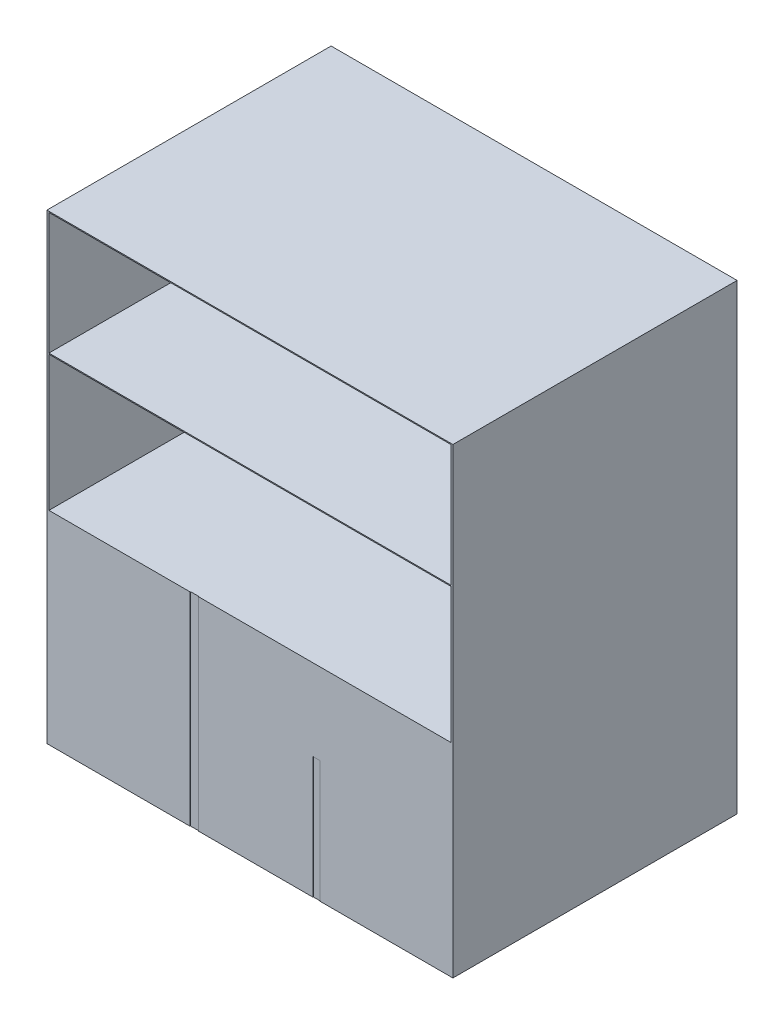
ISO-10303-21;
HEADER;
FILE_DESCRIPTION(('STEP AP214'),'2;1');
FILE_NAME('part.step','',(''),(''),'','','');
FILE_SCHEMA(('AUTOMOTIVE_DESIGN { 1 0 10303 214 1 1 1 1 }'));
ENDSEC;
DATA;
#1=APPLICATION_CONTEXT('core data for automotive mechanical design processes');
#2=APPLICATION_PROTOCOL_DEFINITION('international standard','automotive_design',2000,#1);
#3=PRODUCT_CONTEXT('',#1,'mechanical');
#4=PRODUCT('Part','Part','',(#3));
#5=PRODUCT_RELATED_PRODUCT_CATEGORY('part','',(#4));
#6=PRODUCT_DEFINITION_FORMATION('','',#4);
#7=PRODUCT_DEFINITION_CONTEXT('part definition',#1,'design');
#8=PRODUCT_DEFINITION('design','',#6,#7);
#9=PRODUCT_DEFINITION_SHAPE('','',#8);
#10=(LENGTH_UNIT() NAMED_UNIT(*) SI_UNIT(.MILLI.,.METRE.));
#11=(NAMED_UNIT(*) PLANE_ANGLE_UNIT() SI_UNIT($,.RADIAN.));
#12=(NAMED_UNIT(*) SI_UNIT($,.STERADIAN.) SOLID_ANGLE_UNIT());
#13=UNCERTAINTY_MEASURE_WITH_UNIT(LENGTH_MEASURE(1.E-05),#10,'distance_accuracy_value','');
#14=(GEOMETRIC_REPRESENTATION_CONTEXT(3) GLOBAL_UNCERTAINTY_ASSIGNED_CONTEXT((#13)) GLOBAL_UNIT_ASSIGNED_CONTEXT((#10,
#11,#12)) REPRESENTATION_CONTEXT('',''));
#15=CARTESIAN_POINT('',(0.,0.,0.));
#16=DIRECTION('',(0.,0.,1.));
#17=DIRECTION('',(1.,0.,0.));
#18=AXIS2_PLACEMENT_3D('',#15,#16,#17);
#19=CARTESIAN_POINT('',(1000.,1000.,-700.));
#20=DIRECTION('',(-1.,0.,0.));
#21=DIRECTION('',(0.,0.,1.));
#22=AXIS2_PLACEMENT_3D('',#19,#20,#21);
#23=PLANE('',#22);
#24=DIRECTION('',(0.,0.,-1.));
#25=VECTOR('',#24,1.);
#26=CARTESIAN_POINT('',(1000.,0.,-700.));
#27=LINE('',#26,#25);
#28=CARTESIAN_POINT('',(1000.,0.,700.));
#29=VERTEX_POINT('',#28);
#30=CARTESIAN_POINT('',(1000.,0.,-700.));
#31=VERTEX_POINT('',#30);
#32=EDGE_CURVE('E297',#29,#31,#27,.T.);
#33=ORIENTED_EDGE('',*,*,#32,.T.);
#34=DIRECTION('',(0.,-1.,0.));
#35=VECTOR('',#34,1.);
#36=CARTESIAN_POINT('',(1000.,1000.,-700.));
#37=LINE('',#36,#35);
#38=CARTESIAN_POINT('',(1000.,2276.,-700.));
#39=VERTEX_POINT('',#38);
#40=EDGE_CURVE('E11',#39,#31,#37,.T.);
#41=ORIENTED_EDGE('',*,*,#40,.F.);
#42=DIRECTION('',(0.,0.,-1.));
#43=VECTOR('',#42,1.);
#44=CARTESIAN_POINT('',(1000.,2276.,-700.));
#45=LINE('',#44,#43);
#46=CARTESIAN_POINT('',(1000.,2276.,700.));
#47=VERTEX_POINT('',#46);
#48=EDGE_CURVE('E216',#47,#39,#45,.T.);
#49=ORIENTED_EDGE('',*,*,#48,.F.);
#50=DIRECTION('',(0.,-1.,0.));
#51=VECTOR('',#50,1.);
#52=CARTESIAN_POINT('',(1000.,1000.,700.));
#53=LINE('',#52,#51);
#54=EDGE_CURVE('E308',#47,#29,#53,.T.);
#55=ORIENTED_EDGE('',*,*,#54,.T.);
#56=EDGE_LOOP('',(#33,#41,#49,#55));
#57=FACE_BOUND('',#56,.T.);
#58=ADVANCED_FACE('F35',(#57),#23,.F.);
#59=CARTESIAN_POINT('',(-1000.,1000.,-700.));
#60=DIRECTION('',(0.,0.,1.));
#61=DIRECTION('',(1.,0.,0.));
#62=AXIS2_PLACEMENT_3D('',#59,#60,#61);
#63=PLANE('',#62);
#64=DIRECTION('',(-1.,0.,0.));
#65=VECTOR('',#64,1.);
#66=CARTESIAN_POINT('',(-1000.,0.,-700.));
#67=LINE('',#66,#65);
#68=CARTESIAN_POINT('',(-1000.,0.,-700.));
#69=VERTEX_POINT('',#68);
#70=EDGE_CURVE('E312',#31,#69,#67,.T.);
#71=ORIENTED_EDGE('',*,*,#70,.T.);
#72=DIRECTION('',(0.,-1.,0.));
#73=VECTOR('',#72,1.);
#74=CARTESIAN_POINT('',(-1000.,1000.,-700.));
#75=LINE('',#74,#73);
#76=CARTESIAN_POINT('',(-1000.,2276.,-700.));
#77=VERTEX_POINT('',#76);
#78=EDGE_CURVE('E42',#77,#69,#75,.T.);
#79=ORIENTED_EDGE('',*,*,#78,.F.);
#80=DIRECTION('',(-1.,0.,0.));
#81=VECTOR('',#80,1.);
#82=CARTESIAN_POINT('',(-1000.,2276.,-700.));
#83=LINE('',#82,#81);
#84=EDGE_CURVE('E219',#39,#77,#83,.T.);
#85=ORIENTED_EDGE('',*,*,#84,.F.);
#86=ORIENTED_EDGE('',*,*,#40,.T.);
#87=EDGE_LOOP('',(#71,#79,#85,#86));
#88=FACE_BOUND('',#87,.T.);
#89=ADVANCED_FACE('F347',(#88),#63,.F.);
#90=CARTESIAN_POINT('',(-1000.,1000.,-700.));
#91=DIRECTION('',(1.,0.,0.));
#92=DIRECTION('',(0.,0.,-1.));
#93=AXIS2_PLACEMENT_3D('',#90,#91,#92);
#94=PLANE('',#93);
#95=DIRECTION('',(0.,0.,1.));
#96=VECTOR('',#95,1.);
#97=CARTESIAN_POINT('',(-1000.,0.,-700.));
#98=LINE('',#97,#96);
#99=CARTESIAN_POINT('',(-999.999999999999,0.,700.));
#100=VERTEX_POINT('',#99);
#101=EDGE_CURVE('E314',#69,#100,#98,.T.);
#102=ORIENTED_EDGE('',*,*,#101,.T.);
#103=DIRECTION('',(0.,-1.,0.));
#104=VECTOR('',#103,1.);
#105=CARTESIAN_POINT('',(-999.999999999999,1000.,700.));
#106=LINE('',#105,#104);
#107=CARTESIAN_POINT('',(-999.999999999999,2276.,700.));
#108=VERTEX_POINT('',#107);
#109=EDGE_CURVE('E323',#108,#100,#106,.T.);
#110=ORIENTED_EDGE('',*,*,#109,.F.);
#111=DIRECTION('',(0.,0.,1.));
#112=VECTOR('',#111,1.);
#113=CARTESIAN_POINT('',(-999.999999999999,2276.,700.));
#114=LINE('',#113,#112);
#115=EDGE_CURVE('E210',#77,#108,#114,.T.);
#116=ORIENTED_EDGE('',*,*,#115,.F.);
#117=ORIENTED_EDGE('',*,*,#78,.T.);
#118=EDGE_LOOP('',(#102,#110,#116,#117));
#119=FACE_BOUND('',#118,.T.);
#120=ADVANCED_FACE('F329',(#119),#94,.F.);
#121=CARTESIAN_POINT('',(-999.999999999999,1000.,700.));
#122=DIRECTION('',(0.,0.,-1.));
#123=DIRECTION('',(-1.,0.,0.));
#124=AXIS2_PLACEMENT_3D('',#121,#122,#123);
#125=PLANE('',#124);
#126=DIRECTION('',(-1.,0.,0.));
#127=VECTOR('',#126,1.);
#128=CARTESIAN_POINT('',(-989.999999999999,2271.,700.));
#129=LINE('',#128,#127);
#130=CARTESIAN_POINT('',(990.000000000001,2271.,700.));
#131=VERTEX_POINT('',#130);
#132=CARTESIAN_POINT('',(-989.999999999999,2271.,700.));
#133=VERTEX_POINT('',#132);
#134=EDGE_CURVE('E200',#131,#133,#129,.T.);
#135=ORIENTED_EDGE('',*,*,#134,.F.);
#136=DIRECTION('',(0.,1.,0.));
#137=VECTOR('',#136,1.);
#138=CARTESIAN_POINT('',(990.,2271.,700.));
#139=LINE('',#138,#137);
#140=CARTESIAN_POINT('',(990.000000000001,1671.,700.));
#141=VERTEX_POINT('',#140);
#142=EDGE_CURVE('E49',#141,#131,#139,.T.);
#143=ORIENTED_EDGE('',*,*,#142,.F.);
#144=DIRECTION('',(1.,0.,0.));
#145=VECTOR('',#144,1.);
#146=CARTESIAN_POINT('',(-989.999999999999,1671.,700.));
#147=LINE('',#146,#145);
#148=CARTESIAN_POINT('',(-989.999999999999,1671.,700.));
#149=VERTEX_POINT('',#148);
#150=EDGE_CURVE('E191',#149,#141,#147,.T.);
#151=ORIENTED_EDGE('',*,*,#150,.F.);
#152=DIRECTION('',(0.,-1.,0.));
#153=VECTOR('',#152,1.);
#154=CARTESIAN_POINT('',(-989.999999999999,2271.,700.));
#155=LINE('',#154,#153);
#156=EDGE_CURVE('E194',#133,#149,#155,.T.);
#157=ORIENTED_EDGE('',*,*,#156,.F.);
#158=EDGE_LOOP('',(#135,#143,#151,#157));
#159=FACE_BOUND('',#158,.T.);
#160=DIRECTION('',(1.,0.,0.));
#161=VECTOR('',#160,1.);
#162=CARTESIAN_POINT('',(-999.999999999999,0.,700.));
#163=LINE('',#162,#161);
#164=CARTESIAN_POINT('',(-294.648301385412,0.,700.));
#165=VERTEX_POINT('',#164);
#166=EDGE_CURVE('E317',#100,#165,#163,.T.);
#167=ORIENTED_EDGE('',*,*,#166,.T.);
#168=DIRECTION('',(0.,-1.,0.));
#169=VECTOR('',#168,1.);
#170=CARTESIAN_POINT('',(-294.648301385412,1000.,700.));
#171=LINE('',#170,#169);
#172=CARTESIAN_POINT('',(-294.648301385412,1000.,700.));
#173=VERTEX_POINT('',#172);
#174=EDGE_CURVE('E284',#173,#165,#171,.T.);
#175=ORIENTED_EDGE('',*,*,#174,.F.);
#176=DIRECTION('',(1.,0.,0.));
#177=VECTOR('',#176,1.);
#178=CARTESIAN_POINT('',(-999.999999999999,1000.,700.));
#179=LINE('',#178,#177);
#180=CARTESIAN_POINT('',(-989.999999999999,1000.,700.));
#181=VERTEX_POINT('',#180);
#182=EDGE_CURVE('E306',#181,#173,#179,.T.);
#183=ORIENTED_EDGE('',*,*,#182,.F.);
#184=DIRECTION('',(0.,-1.,0.));
#185=VECTOR('',#184,1.);
#186=CARTESIAN_POINT('',(-989.999999999999,1666.,700.));
#187=LINE('',#186,#185);
#188=CARTESIAN_POINT('',(-989.999999999999,1666.,700.));
#189=VERTEX_POINT('',#188);
#190=EDGE_CURVE('E248',#189,#181,#187,.T.);
#191=ORIENTED_EDGE('',*,*,#190,.F.);
#192=DIRECTION('',(1.,0.,0.));
#193=VECTOR('',#192,1.);
#194=CARTESIAN_POINT('',(1000.,1666.,700.));
#195=LINE('',#194,#193);
#196=CARTESIAN_POINT('',(990.,1666.,700.));
#197=VERTEX_POINT('',#196);
#198=EDGE_CURVE('E206',#189,#197,#195,.T.);
#199=ORIENTED_EDGE('',*,*,#198,.T.);
#200=DIRECTION('',(0.,-1.,0.));
#201=VECTOR('',#200,1.);
#202=CARTESIAN_POINT('',(990.,1666.,700.));
#203=LINE('',#202,#201);
#204=CARTESIAN_POINT('',(990.,1000.,700.));
#205=VERTEX_POINT('',#204);
#206=EDGE_CURVE('E234',#197,#205,#203,.T.);
#207=ORIENTED_EDGE('',*,*,#206,.T.);
#208=CARTESIAN_POINT('',(-253.92681466005,1000.,700.));
#209=VERTEX_POINT('',#208);
#210=EDGE_CURVE('E309',#209,#205,#179,.T.);
#211=ORIENTED_EDGE('',*,*,#210,.F.);
#212=DIRECTION('',(0.,1.,0.));
#213=VECTOR('',#212,1.);
#214=CARTESIAN_POINT('',(-253.92681466005,1000.,700.));
#215=LINE('',#214,#213);
#216=CARTESIAN_POINT('',(-253.92681466005,0.,700.));
#217=VERTEX_POINT('',#216);
#218=EDGE_CURVE('E273',#217,#209,#215,.T.);
#219=ORIENTED_EDGE('',*,*,#218,.F.);
#220=CARTESIAN_POINT('',(310.300720099746,0.,700.));
#221=VERTEX_POINT('',#220);
#222=EDGE_CURVE('E320',#217,#221,#163,.T.);
#223=ORIENTED_EDGE('',*,*,#222,.T.);
#224=DIRECTION('',(0.,-1.,0.));
#225=VECTOR('',#224,1.);
#226=CARTESIAN_POINT('',(310.300720099746,599.999999999999,700.));
#227=LINE('',#226,#225);
#228=CARTESIAN_POINT('',(310.300720099746,599.999999999999,700.));
#229=VERTEX_POINT('',#228);
#230=EDGE_CURVE('E256',#229,#221,#227,.T.);
#231=ORIENTED_EDGE('',*,*,#230,.F.);
#232=DIRECTION('',(-1.,0.,0.));
#233=VECTOR('',#232,1.);
#234=CARTESIAN_POINT('',(310.300720099746,599.999999999999,700.));
#235=LINE('',#234,#233);
#236=CARTESIAN_POINT('',(344.91412071623,599.999999999999,700.));
#237=VERTEX_POINT('',#236);
#238=EDGE_CURVE('E267',#237,#229,#235,.T.);
#239=ORIENTED_EDGE('',*,*,#238,.F.);
#240=DIRECTION('',(0.,1.,0.));
#241=VECTOR('',#240,1.);
#242=CARTESIAN_POINT('',(344.91412071623,599.999999999999,700.));
#243=LINE('',#242,#241);
#244=CARTESIAN_POINT('',(344.91412071623,0.,700.));
#245=VERTEX_POINT('',#244);
#246=EDGE_CURVE('E251',#245,#237,#243,.T.);
#247=ORIENTED_EDGE('',*,*,#246,.F.);
#248=EDGE_CURVE('E316',#245,#29,#163,.T.);
#249=ORIENTED_EDGE('',*,*,#248,.T.);
#250=ORIENTED_EDGE('',*,*,#54,.F.);
#251=DIRECTION('',(1.,0.,0.));
#252=VECTOR('',#251,1.);
#253=CARTESIAN_POINT('',(1000.,2276.,700.));
#254=LINE('',#253,#252);
#255=EDGE_CURVE('E213',#108,#47,#254,.T.);
#256=ORIENTED_EDGE('',*,*,#255,.F.);
#257=ORIENTED_EDGE('',*,*,#109,.T.);
#258=EDGE_LOOP('',(#167,#175,#183,#191,#199,#207,#211,#219,#223,#231,#239,#247,#249,#250,#256,#257));
#259=FACE_BOUND('',#258,.T.);
#260=ADVANCED_FACE('F341',(#159,#259),#125,.F.);
#261=CARTESIAN_POINT('',(0.,1000.,0.));
#262=DIRECTION('',(0.,1.,0.));
#263=DIRECTION('',(0.,0.,1.));
#264=AXIS2_PLACEMENT_3D('',#261,#262,#263);
#265=PLANE('',#264);
#266=DIRECTION('',(0.,0.,1.));
#267=VECTOR('',#266,1.);
#268=CARTESIAN_POINT('',(990.,1000.,690.));
#269=LINE('',#268,#267);
#270=CARTESIAN_POINT('',(990.,1000.,-690.));
#271=VERTEX_POINT('',#270);
#272=EDGE_CURVE('E57',#271,#205,#269,.T.);
#273=ORIENTED_EDGE('',*,*,#272,.F.);
#274=DIRECTION('',(1.,0.,0.));
#275=VECTOR('',#274,1.);
#276=CARTESIAN_POINT('',(-989.999999999999,1000.,-690.));
#277=LINE('',#276,#275);
#278=CARTESIAN_POINT('',(-989.999999999999,1000.,-690.));
#279=VERTEX_POINT('',#278);
#280=EDGE_CURVE('E237',#279,#271,#277,.T.);
#281=ORIENTED_EDGE('',*,*,#280,.F.);
#282=DIRECTION('',(0.,0.,-1.));
#283=VECTOR('',#282,1.);
#284=CARTESIAN_POINT('',(-989.999999999999,1000.,690.));
#285=LINE('',#284,#283);
#286=EDGE_CURVE('E222',#181,#279,#285,.T.);
#287=ORIENTED_EDGE('',*,*,#286,.F.);
#288=ORIENTED_EDGE('',*,*,#182,.T.);
#289=DIRECTION('',(0.,0.,1.));
#290=VECTOR('',#289,1.);
#291=CARTESIAN_POINT('',(-294.648301385412,1000.,698.));
#292=LINE('',#291,#290);
#293=CARTESIAN_POINT('',(-294.648301385412,1000.,698.));
#294=VERTEX_POINT('',#293);
#295=EDGE_CURVE('E301',#294,#173,#292,.T.);
#296=ORIENTED_EDGE('',*,*,#295,.F.);
#297=DIRECTION('',(-1.,0.,0.));
#298=VECTOR('',#297,1.);
#299=CARTESIAN_POINT('',(-294.648301385412,1000.,698.));
#300=LINE('',#299,#298);
#301=CARTESIAN_POINT('',(-253.92681466005,1000.,698.));
#302=VERTEX_POINT('',#301);
#303=EDGE_CURVE('E283',#302,#294,#300,.T.);
#304=ORIENTED_EDGE('',*,*,#303,.F.);
#305=DIRECTION('',(0.,0.,1.));
#306=VECTOR('',#305,1.);
#307=CARTESIAN_POINT('',(-253.92681466005,1000.,698.));
#308=LINE('',#307,#306);
#309=EDGE_CURVE('E292',#302,#209,#308,.T.);
#310=ORIENTED_EDGE('',*,*,#309,.T.);
#311=ORIENTED_EDGE('',*,*,#210,.T.);
#312=EDGE_LOOP('',(#273,#281,#287,#288,#296,#304,#310,#311));
#313=FACE_BOUND('',#312,.T.);
#314=ADVANCED_FACE('F393',(#313),#265,.T.);
#315=CARTESIAN_POINT('',(0.,0.,0.));
#316=DIRECTION('',(0.,1.,0.));
#317=DIRECTION('',(0.,0.,1.));
#318=AXIS2_PLACEMENT_3D('',#315,#316,#317);
#319=PLANE('',#318);
#320=ORIENTED_EDGE('',*,*,#248,.F.);
#321=DIRECTION('',(0.,0.,1.));
#322=VECTOR('',#321,1.);
#323=CARTESIAN_POINT('',(344.91412071623,0.,698.));
#324=LINE('',#323,#322);
#325=CARTESIAN_POINT('',(344.91412071623,0.,698.));
#326=VERTEX_POINT('',#325);
#327=EDGE_CURVE('E271',#326,#245,#324,.T.);
#328=ORIENTED_EDGE('',*,*,#327,.F.);
#329=DIRECTION('',(1.,0.,0.));
#330=VECTOR('',#329,1.);
#331=CARTESIAN_POINT('',(310.300720099746,0.,698.));
#332=LINE('',#331,#330);
#333=CARTESIAN_POINT('',(310.300720099746,0.,698.));
#334=VERTEX_POINT('',#333);
#335=EDGE_CURVE('E261',#334,#326,#332,.T.);
#336=ORIENTED_EDGE('',*,*,#335,.F.);
#337=DIRECTION('',(0.,0.,1.));
#338=VECTOR('',#337,1.);
#339=CARTESIAN_POINT('',(310.300720099746,0.,698.));
#340=LINE('',#339,#338);
#341=EDGE_CURVE('E274',#334,#221,#340,.T.);
#342=ORIENTED_EDGE('',*,*,#341,.T.);
#343=ORIENTED_EDGE('',*,*,#222,.F.);
#344=DIRECTION('',(0.,0.,1.));
#345=VECTOR('',#344,1.);
#346=CARTESIAN_POINT('',(-253.92681466005,0.,698.));
#347=LINE('',#346,#345);
#348=CARTESIAN_POINT('',(-253.92681466005,0.,698.));
#349=VERTEX_POINT('',#348);
#350=EDGE_CURVE('E295',#349,#217,#347,.T.);
#351=ORIENTED_EDGE('',*,*,#350,.F.);
#352=DIRECTION('',(1.,0.,0.));
#353=VECTOR('',#352,1.);
#354=CARTESIAN_POINT('',(-294.648301385412,0.,698.));
#355=LINE('',#354,#353);
#356=CARTESIAN_POINT('',(-294.648301385412,0.,698.));
#357=VERTEX_POINT('',#356);
#358=EDGE_CURVE('E289',#357,#349,#355,.T.);
#359=ORIENTED_EDGE('',*,*,#358,.F.);
#360=DIRECTION('',(0.,0.,1.));
#361=VECTOR('',#360,1.);
#362=CARTESIAN_POINT('',(-294.648301385412,0.,698.));
#363=LINE('',#362,#361);
#364=EDGE_CURVE('E298',#357,#165,#363,.T.);
#365=ORIENTED_EDGE('',*,*,#364,.T.);
#366=ORIENTED_EDGE('',*,*,#166,.F.);
#367=ORIENTED_EDGE('',*,*,#101,.F.);
#368=ORIENTED_EDGE('',*,*,#70,.F.);
#369=ORIENTED_EDGE('',*,*,#32,.F.);
#370=EDGE_LOOP('',(#320,#328,#336,#342,#343,#351,#359,#365,#366,#367,#368,#369));
#371=FACE_BOUND('',#370,.T.);
#372=ADVANCED_FACE('F335',(#371),#319,.F.);
#373=CARTESIAN_POINT('',(-253.92681466005,1000.,698.));
#374=DIRECTION('',(1.,0.,0.));
#375=DIRECTION('',(0.,1.,0.));
#376=AXIS2_PLACEMENT_3D('',#373,#374,#375);
#377=PLANE('',#376);
#378=ORIENTED_EDGE('',*,*,#218,.T.);
#379=ORIENTED_EDGE('',*,*,#309,.F.);
#380=DIRECTION('',(0.,1.,0.));
#381=VECTOR('',#380,1.);
#382=CARTESIAN_POINT('',(-253.92681466005,1000.,698.));
#383=LINE('',#382,#381);
#384=EDGE_CURVE('E280',#349,#302,#383,.T.);
#385=ORIENTED_EDGE('',*,*,#384,.F.);
#386=ORIENTED_EDGE('',*,*,#350,.T.);
#387=EDGE_LOOP('',(#378,#379,#385,#386));
#388=FACE_BOUND('',#387,.T.);
#389=ADVANCED_FACE('F397',(#388),#377,.F.);
#390=CARTESIAN_POINT('',(-294.648301385412,1000.,698.));
#391=DIRECTION('',(-1.,0.,0.));
#392=DIRECTION('',(0.,0.,1.));
#393=AXIS2_PLACEMENT_3D('',#390,#391,#392);
#394=PLANE('',#393);
#395=ORIENTED_EDGE('',*,*,#174,.T.);
#396=ORIENTED_EDGE('',*,*,#364,.F.);
#397=DIRECTION('',(0.,-1.,0.));
#398=VECTOR('',#397,1.);
#399=CARTESIAN_POINT('',(-294.648301385412,1000.,698.));
#400=LINE('',#399,#398);
#401=EDGE_CURVE('E287',#294,#357,#400,.T.);
#402=ORIENTED_EDGE('',*,*,#401,.F.);
#403=ORIENTED_EDGE('',*,*,#295,.T.);
#404=EDGE_LOOP('',(#395,#396,#402,#403));
#405=FACE_BOUND('',#404,.T.);
#406=ADVANCED_FACE('F402',(#405),#394,.F.);
#407=CARTESIAN_POINT('',(0.,0.,698.));
#408=DIRECTION('',(0.,0.,1.));
#409=DIRECTION('',(1.,0.,0.));
#410=AXIS2_PLACEMENT_3D('',#407,#408,#409);
#411=PLANE('',#410);
#412=ORIENTED_EDGE('',*,*,#384,.T.);
#413=ORIENTED_EDGE('',*,*,#303,.T.);
#414=ORIENTED_EDGE('',*,*,#401,.T.);
#415=ORIENTED_EDGE('',*,*,#358,.T.);
#416=EDGE_LOOP('',(#412,#413,#414,#415));
#417=FACE_BOUND('',#416,.T.);
#418=ADVANCED_FACE('F406',(#417),#411,.T.);
#419=CARTESIAN_POINT('',(344.91412071623,599.999999999999,698.));
#420=DIRECTION('',(1.,0.,0.));
#421=DIRECTION('',(0.,1.,0.));
#422=AXIS2_PLACEMENT_3D('',#419,#420,#421);
#423=PLANE('',#422);
#424=ORIENTED_EDGE('',*,*,#246,.T.);
#425=DIRECTION('',(0.,0.,1.));
#426=VECTOR('',#425,1.);
#427=CARTESIAN_POINT('',(344.91412071623,599.999999999999,698.));
#428=LINE('',#427,#426);
#429=CARTESIAN_POINT('',(344.91412071623,599.999999999999,698.));
#430=VERTEX_POINT('',#429);
#431=EDGE_CURVE('E264',#430,#237,#428,.T.);
#432=ORIENTED_EDGE('',*,*,#431,.F.);
#433=DIRECTION('',(0.,1.,0.));
#434=VECTOR('',#433,1.);
#435=CARTESIAN_POINT('',(344.91412071623,599.999999999999,698.));
#436=LINE('',#435,#434);
#437=EDGE_CURVE('E252',#326,#430,#436,.T.);
#438=ORIENTED_EDGE('',*,*,#437,.F.);
#439=ORIENTED_EDGE('',*,*,#327,.T.);
#440=EDGE_LOOP('',(#424,#432,#438,#439));
#441=FACE_BOUND('',#440,.T.);
#442=ADVANCED_FACE('F367',(#441),#423,.F.);
#443=CARTESIAN_POINT('',(310.300720099746,599.999999999999,698.));
#444=DIRECTION('',(-1.,0.,0.));
#445=DIRECTION('',(0.,0.,1.));
#446=AXIS2_PLACEMENT_3D('',#443,#444,#445);
#447=PLANE('',#446);
#448=ORIENTED_EDGE('',*,*,#230,.T.);
#449=ORIENTED_EDGE('',*,*,#341,.F.);
#450=DIRECTION('',(0.,-1.,0.));
#451=VECTOR('',#450,1.);
#452=CARTESIAN_POINT('',(310.300720099746,599.999999999999,698.));
#453=LINE('',#452,#451);
#454=CARTESIAN_POINT('',(310.300720099746,599.999999999999,698.));
#455=VERTEX_POINT('',#454);
#456=EDGE_CURVE('E259',#455,#334,#453,.T.);
#457=ORIENTED_EDGE('',*,*,#456,.F.);
#458=DIRECTION('',(0.,0.,1.));
#459=VECTOR('',#458,1.);
#460=CARTESIAN_POINT('',(310.300720099746,599.999999999999,698.));
#461=LINE('',#460,#459);
#462=EDGE_CURVE('E277',#455,#229,#461,.T.);
#463=ORIENTED_EDGE('',*,*,#462,.T.);
#464=EDGE_LOOP('',(#448,#449,#457,#463));
#465=FACE_BOUND('',#464,.T.);
#466=ADVANCED_FACE('F362',(#465),#447,.F.);
#467=CARTESIAN_POINT('',(310.300720099746,599.999999999999,698.));
#468=DIRECTION('',(0.,1.,0.));
#469=DIRECTION('',(0.,0.,1.));
#470=AXIS2_PLACEMENT_3D('',#467,#468,#469);
#471=PLANE('',#470);
#472=ORIENTED_EDGE('',*,*,#238,.T.);
#473=ORIENTED_EDGE('',*,*,#462,.F.);
#474=DIRECTION('',(-1.,0.,0.));
#475=VECTOR('',#474,1.);
#476=CARTESIAN_POINT('',(310.300720099746,599.999999999999,698.));
#477=LINE('',#476,#475);
#478=EDGE_CURVE('E255',#430,#455,#477,.T.);
#479=ORIENTED_EDGE('',*,*,#478,.F.);
#480=ORIENTED_EDGE('',*,*,#431,.T.);
#481=EDGE_LOOP('',(#472,#473,#479,#480));
#482=FACE_BOUND('',#481,.T.);
#483=ADVANCED_FACE('F365',(#482),#471,.F.);
#484=CARTESIAN_POINT('',(0.,0.,698.));
#485=DIRECTION('',(0.,0.,1.));
#486=DIRECTION('',(1.,0.,0.));
#487=AXIS2_PLACEMENT_3D('',#484,#485,#486);
#488=PLANE('',#487);
#489=ORIENTED_EDGE('',*,*,#437,.T.);
#490=ORIENTED_EDGE('',*,*,#478,.T.);
#491=ORIENTED_EDGE('',*,*,#456,.T.);
#492=ORIENTED_EDGE('',*,*,#335,.T.);
#493=EDGE_LOOP('',(#489,#490,#491,#492));
#494=FACE_BOUND('',#493,.T.);
#495=ADVANCED_FACE('F369',(#494),#488,.T.);
#496=CARTESIAN_POINT('',(-989.999999999999,1666.,690.));
#497=DIRECTION('',(-1.,0.,0.));
#498=DIRECTION('',(0.,0.,1.));
#499=AXIS2_PLACEMENT_3D('',#496,#497,#498);
#500=PLANE('',#499);
#501=ORIENTED_EDGE('',*,*,#286,.T.);
#502=DIRECTION('',(0.,-1.,0.));
#503=VECTOR('',#502,1.);
#504=CARTESIAN_POINT('',(-989.999999999999,1666.,-690.));
#505=LINE('',#504,#503);
#506=CARTESIAN_POINT('',(-989.999999999999,1666.,-690.));
#507=VERTEX_POINT('',#506);
#508=EDGE_CURVE('E245',#507,#279,#505,.T.);
#509=ORIENTED_EDGE('',*,*,#508,.F.);
#510=DIRECTION('',(0.,0.,-1.));
#511=VECTOR('',#510,1.);
#512=CARTESIAN_POINT('',(-989.999999999999,1666.,690.));
#513=LINE('',#512,#511);
#514=EDGE_CURVE('E225',#189,#507,#513,.T.);
#515=ORIENTED_EDGE('',*,*,#514,.F.);
#516=ORIENTED_EDGE('',*,*,#190,.T.);
#517=EDGE_LOOP('',(#501,#509,#515,#516));
#518=FACE_BOUND('',#517,.T.);
#519=ADVANCED_FACE('F371',(#518),#500,.F.);
#520=CARTESIAN_POINT('',(-989.999999999999,1666.,-690.));
#521=DIRECTION('',(0.,0.,-1.));
#522=DIRECTION('',(-1.,0.,0.));
#523=AXIS2_PLACEMENT_3D('',#520,#521,#522);
#524=PLANE('',#523);
#525=ORIENTED_EDGE('',*,*,#280,.T.);
#526=DIRECTION('',(0.,-1.,0.));
#527=VECTOR('',#526,1.);
#528=CARTESIAN_POINT('',(990.,1666.,-690.));
#529=LINE('',#528,#527);
#530=CARTESIAN_POINT('',(990.,1666.,-690.));
#531=VERTEX_POINT('',#530);
#532=EDGE_CURVE('E242',#531,#271,#529,.T.);
#533=ORIENTED_EDGE('',*,*,#532,.F.);
#534=DIRECTION('',(1.,0.,0.));
#535=VECTOR('',#534,1.);
#536=CARTESIAN_POINT('',(-989.999999999999,1666.,-690.));
#537=LINE('',#536,#535);
#538=EDGE_CURVE('E228',#507,#531,#537,.T.);
#539=ORIENTED_EDGE('',*,*,#538,.F.);
#540=ORIENTED_EDGE('',*,*,#508,.T.);
#541=EDGE_LOOP('',(#525,#533,#539,#540));
#542=FACE_BOUND('',#541,.T.);
#543=ADVANCED_FACE('F377',(#542),#524,.F.);
#544=CARTESIAN_POINT('',(990.,1666.,690.));
#545=DIRECTION('',(1.,0.,0.));
#546=DIRECTION('',(0.,0.,-1.));
#547=AXIS2_PLACEMENT_3D('',#544,#545,#546);
#548=PLANE('',#547);
#549=ORIENTED_EDGE('',*,*,#272,.T.);
#550=ORIENTED_EDGE('',*,*,#206,.F.);
#551=DIRECTION('',(0.,0.,1.));
#552=VECTOR('',#551,1.);
#553=CARTESIAN_POINT('',(990.,1666.,-690.));
#554=LINE('',#553,#552);
#555=EDGE_CURVE('E231',#531,#197,#554,.T.);
#556=ORIENTED_EDGE('',*,*,#555,.F.);
#557=ORIENTED_EDGE('',*,*,#532,.T.);
#558=EDGE_LOOP('',(#549,#550,#556,#557));
#559=FACE_BOUND('',#558,.T.);
#560=ADVANCED_FACE('F468',(#559),#548,.F.);
#561=CARTESIAN_POINT('',(0.,2276.,0.));
#562=DIRECTION('',(0.,-1.,0.));
#563=DIRECTION('',(0.,0.,-1.));
#564=AXIS2_PLACEMENT_3D('',#561,#562,#563);
#565=PLANE('',#564);
#566=ORIENTED_EDGE('',*,*,#115,.T.);
#567=ORIENTED_EDGE('',*,*,#255,.T.);
#568=ORIENTED_EDGE('',*,*,#48,.T.);
#569=ORIENTED_EDGE('',*,*,#84,.T.);
#570=EDGE_LOOP('',(#566,#567,#568,#569));
#571=FACE_BOUND('',#570,.T.);
#572=ADVANCED_FACE('F346',(#571),#565,.F.);
#573=CARTESIAN_POINT('',(0.,1666.,0.));
#574=DIRECTION('',(0.,-1.,0.));
#575=DIRECTION('',(0.,0.,-1.));
#576=AXIS2_PLACEMENT_3D('',#573,#574,#575);
#577=PLANE('',#576);
#578=ORIENTED_EDGE('',*,*,#198,.F.);
#579=ORIENTED_EDGE('',*,*,#514,.T.);
#580=ORIENTED_EDGE('',*,*,#538,.T.);
#581=ORIENTED_EDGE('',*,*,#555,.T.);
#582=EDGE_LOOP('',(#578,#579,#580,#581));
#583=FACE_BOUND('',#582,.T.);
#584=ADVANCED_FACE('F488',(#583),#577,.T.);
#585=CARTESIAN_POINT('',(990.,2271.,-600.000000000002));
#586=DIRECTION('',(1.,0.,0.));
#587=DIRECTION('',(0.,1.,0.));
#588=AXIS2_PLACEMENT_3D('',#585,#586,#587);
#589=PLANE('',#588);
#590=ORIENTED_EDGE('',*,*,#142,.T.);
#591=DIRECTION('',(0.,0.,1.));
#592=VECTOR('',#591,1.);
#593=CARTESIAN_POINT('',(990.,2271.,-600.000000000002));
#594=LINE('',#593,#592);
#595=CARTESIAN_POINT('',(990.,2271.,-600.000000000002));
#596=VERTEX_POINT('',#595);
#597=EDGE_CURVE('E169',#596,#131,#594,.T.);
#598=ORIENTED_EDGE('',*,*,#597,.F.);
#599=DIRECTION('',(0.,1.,0.));
#600=VECTOR('',#599,1.);
#601=CARTESIAN_POINT('',(990.,2271.,-600.000000000002));
#602=LINE('',#601,#600);
#603=CARTESIAN_POINT('',(990.000000000001,1671.,-600.000000000002));
#604=VERTEX_POINT('',#603);
#605=EDGE_CURVE('E173',#604,#596,#602,.T.);
#606=ORIENTED_EDGE('',*,*,#605,.F.);
#607=DIRECTION('',(0.,0.,1.));
#608=VECTOR('',#607,1.);
#609=CARTESIAN_POINT('',(990.000000000001,1671.,-600.000000000002));
#610=LINE('',#609,#608);
#611=EDGE_CURVE('E204',#604,#141,#610,.T.);
#612=ORIENTED_EDGE('',*,*,#611,.T.);
#613=EDGE_LOOP('',(#590,#598,#606,#612));
#614=FACE_BOUND('',#613,.T.);
#615=ADVANCED_FACE('F171',(#614),#589,.F.);
#616=CARTESIAN_POINT('',(-989.999999999999,1671.,-600.000000000002));
#617=DIRECTION('',(0.,-1.,0.));
#618=DIRECTION('',(0.,0.,-1.));
#619=AXIS2_PLACEMENT_3D('',#616,#617,#618);
#620=PLANE('',#619);
#621=ORIENTED_EDGE('',*,*,#150,.T.);
#622=ORIENTED_EDGE('',*,*,#611,.F.);
#623=DIRECTION('',(1.,0.,0.));
#624=VECTOR('',#623,1.);
#625=CARTESIAN_POINT('',(-989.999999999999,1671.,-600.000000000002));
#626=LINE('',#625,#624);
#627=CARTESIAN_POINT('',(-989.999999999999,1671.,-600.000000000002));
#628=VERTEX_POINT('',#627);
#629=EDGE_CURVE('E179',#628,#604,#626,.T.);
#630=ORIENTED_EDGE('',*,*,#629,.F.);
#631=DIRECTION('',(0.,0.,1.));
#632=VECTOR('',#631,1.);
#633=CARTESIAN_POINT('',(-989.999999999999,1671.,-600.000000000002));
#634=LINE('',#633,#632);
#635=EDGE_CURVE('E207',#628,#149,#634,.T.);
#636=ORIENTED_EDGE('',*,*,#635,.T.);
#637=EDGE_LOOP('',(#621,#622,#630,#636));
#638=FACE_BOUND('',#637,.T.);
#639=ADVANCED_FACE('F511',(#638),#620,.F.);
#640=CARTESIAN_POINT('',(-989.999999999999,2271.,-600.000000000002));
#641=DIRECTION('',(-1.,0.,0.));
#642=DIRECTION('',(0.,-1.,0.));
#643=AXIS2_PLACEMENT_3D('',#640,#641,#642);
#644=PLANE('',#643);
#645=ORIENTED_EDGE('',*,*,#156,.T.);
#646=ORIENTED_EDGE('',*,*,#635,.F.);
#647=DIRECTION('',(0.,-1.,0.));
#648=VECTOR('',#647,1.);
#649=CARTESIAN_POINT('',(-989.999999999999,2271.,-600.000000000002));
#650=LINE('',#649,#648);
#651=CARTESIAN_POINT('',(-989.999999999999,2271.,-600.000000000002));
#652=VERTEX_POINT('',#651);
#653=EDGE_CURVE('E187',#652,#628,#650,.T.);
#654=ORIENTED_EDGE('',*,*,#653,.F.);
#655=DIRECTION('',(0.,0.,1.));
#656=VECTOR('',#655,1.);
#657=CARTESIAN_POINT('',(-989.999999999999,2271.,-600.000000000002));
#658=LINE('',#657,#656);
#659=EDGE_CURVE('E178',#652,#133,#658,.T.);
#660=ORIENTED_EDGE('',*,*,#659,.T.);
#661=EDGE_LOOP('',(#645,#646,#654,#660));
#662=FACE_BOUND('',#661,.T.);
#663=ADVANCED_FACE('F520',(#662),#644,.F.);
#664=CARTESIAN_POINT('',(-989.999999999999,2271.,-600.000000000002));
#665=DIRECTION('',(0.,1.,0.));
#666=DIRECTION('',(0.,0.,1.));
#667=AXIS2_PLACEMENT_3D('',#664,#665,#666);
#668=PLANE('',#667);
#669=ORIENTED_EDGE('',*,*,#134,.T.);
#670=ORIENTED_EDGE('',*,*,#659,.F.);
#671=DIRECTION('',(-1.,0.,0.));
#672=VECTOR('',#671,1.);
#673=CARTESIAN_POINT('',(-989.999999999999,2271.,-600.000000000002));
#674=LINE('',#673,#672);
#675=EDGE_CURVE('E182',#596,#652,#674,.T.);
#676=ORIENTED_EDGE('',*,*,#675,.F.);
#677=ORIENTED_EDGE('',*,*,#597,.T.);
#678=EDGE_LOOP('',(#669,#670,#676,#677));
#679=FACE_BOUND('',#678,.T.);
#680=ADVANCED_FACE('F183',(#679),#668,.F.);
#681=CARTESIAN_POINT('',(0.,0.,-600.000000000002));
#682=DIRECTION('',(0.,0.,1.));
#683=DIRECTION('',(1.,0.,0.));
#684=AXIS2_PLACEMENT_3D('',#681,#682,#683);
#685=PLANE('',#684);
#686=ORIENTED_EDGE('',*,*,#605,.T.);
#687=ORIENTED_EDGE('',*,*,#675,.T.);
#688=ORIENTED_EDGE('',*,*,#653,.T.);
#689=ORIENTED_EDGE('',*,*,#629,.T.);
#690=EDGE_LOOP('',(#686,#687,#688,#689));
#691=FACE_BOUND('',#690,.T.);
#692=ADVANCED_FACE('F189',(#691),#685,.T.);
#693=CLOSED_SHELL('',(#58,#89,#120,#260,#314,#372,#389,#406,#418,#442,#466,#483,#495,#519,#543,
#560,#572,#584,#615,#639,#663,#680,#692));
#694=MANIFOLD_SOLID_BREP('B2',#693);
#695=ADVANCED_BREP_SHAPE_REPRESENTATION('',(#18,#694),#14);
#696=SHAPE_DEFINITION_REPRESENTATION(#9,#695);
ENDSEC;
END-ISO-10303-21;
